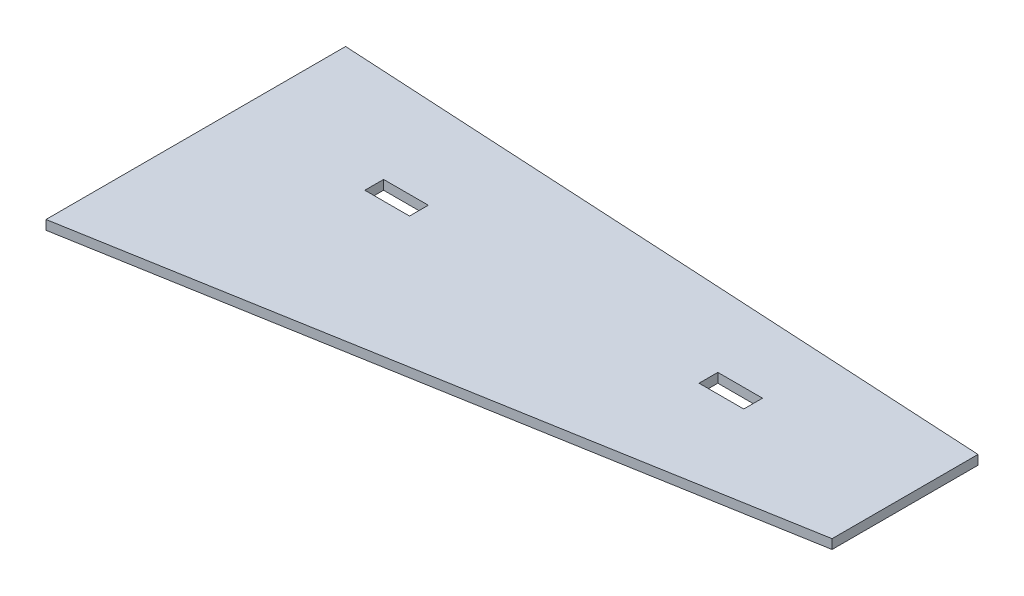
ISO-10303-21;
HEADER;
FILE_DESCRIPTION(('STEP AP214'),'2;1');
FILE_NAME('part.step','',(''),(''),'','','');
FILE_SCHEMA(('AUTOMOTIVE_DESIGN { 1 0 10303 214 1 1 1 1 }'));
ENDSEC;
DATA;
#1=APPLICATION_CONTEXT('core data for automotive mechanical design processes');
#2=APPLICATION_PROTOCOL_DEFINITION('international standard','automotive_design',2000,#1);
#3=PRODUCT_CONTEXT('',#1,'mechanical');
#4=PRODUCT('Part','Part','',(#3));
#5=PRODUCT_RELATED_PRODUCT_CATEGORY('part','',(#4));
#6=PRODUCT_DEFINITION_FORMATION('','',#4);
#7=PRODUCT_DEFINITION_CONTEXT('part definition',#1,'design');
#8=PRODUCT_DEFINITION('design','',#6,#7);
#9=PRODUCT_DEFINITION_SHAPE('','',#8);
#10=(LENGTH_UNIT() NAMED_UNIT(*) SI_UNIT(.MILLI.,.METRE.));
#11=(NAMED_UNIT(*) PLANE_ANGLE_UNIT() SI_UNIT($,.RADIAN.));
#12=(NAMED_UNIT(*) SI_UNIT($,.STERADIAN.) SOLID_ANGLE_UNIT());
#13=UNCERTAINTY_MEASURE_WITH_UNIT(LENGTH_MEASURE(1.E-05),#10,'distance_accuracy_value','');
#14=(GEOMETRIC_REPRESENTATION_CONTEXT(3) GLOBAL_UNCERTAINTY_ASSIGNED_CONTEXT((#13)) GLOBAL_UNIT_ASSIGNED_CONTEXT((#10,
#11,#12)) REPRESENTATION_CONTEXT('',''));
#15=CARTESIAN_POINT('',(0.,0.,0.));
#16=DIRECTION('',(0.,0.,1.));
#17=DIRECTION('',(1.,0.,0.));
#18=AXIS2_PLACEMENT_3D('',#15,#16,#17);
#19=CARTESIAN_POINT('',(0.,5.334,0.));
#20=DIRECTION('',(0.0552977527204317,0.,-0.998469908682315));
#21=DIRECTION('',(-0.998469908682315,0.,-0.0552977527204317));
#22=AXIS2_PLACEMENT_3D('',#19,#20,#21);
#23=PLANE('',#22);
#24=DIRECTION('',(0.998469908682315,0.,0.0552977527204317));
#25=VECTOR('',#24,1.);
#26=CARTESIAN_POINT('',(0.,0.,0.));
#27=LINE('',#26,#25);
#28=CARTESIAN_POINT('',(0.,0.,0.));
#29=VERTEX_POINT('',#28);
#30=CARTESIAN_POINT('',(380.417035207962,0.,21.0684437864845));
#31=VERTEX_POINT('',#30);
#32=EDGE_CURVE('E191',#29,#31,#27,.T.);
#33=ORIENTED_EDGE('',*,*,#32,.F.);
#34=DIRECTION('',(0.,-1.,0.));
#35=VECTOR('',#34,1.);
#36=CARTESIAN_POINT('',(0.,5.334,0.));
#37=LINE('',#36,#35);
#38=CARTESIAN_POINT('',(0.,5.334,0.));
#39=VERTEX_POINT('',#38);
#40=EDGE_CURVE('E11',#39,#29,#37,.T.);
#41=ORIENTED_EDGE('',*,*,#40,.F.);
#42=DIRECTION('',(0.998469908682315,0.,0.0552977527204317));
#43=VECTOR('',#42,1.);
#44=CARTESIAN_POINT('',(0.,5.334,0.));
#45=LINE('',#44,#43);
#46=CARTESIAN_POINT('',(380.417035207962,5.334,21.0684437864845));
#47=VERTEX_POINT('',#46);
#48=EDGE_CURVE('E192',#39,#47,#45,.T.);
#49=ORIENTED_EDGE('',*,*,#48,.T.);
#50=DIRECTION('',(0.,-1.,0.));
#51=VECTOR('',#50,1.);
#52=CARTESIAN_POINT('',(380.417035207962,5.334,21.0684437864845));
#53=LINE('',#52,#51);
#54=EDGE_CURVE('E204',#47,#31,#53,.T.);
#55=ORIENTED_EDGE('',*,*,#54,.T.);
#56=EDGE_LOOP('',(#33,#41,#49,#55));
#57=FACE_BOUND('',#56,.T.);
#58=ADVANCED_FACE('F38',(#57),#23,.T.);
#59=CARTESIAN_POINT('',(0.,5.334,0.));
#60=DIRECTION('',(1.,0.,0.));
#61=DIRECTION('',(0.,0.,-1.));
#62=AXIS2_PLACEMENT_3D('',#59,#60,#61);
#63=PLANE('',#62);
#64=DIRECTION('',(0.,0.,1.));
#65=VECTOR('',#64,1.);
#66=CARTESIAN_POINT('',(0.,0.,0.));
#67=LINE('',#66,#65);
#68=CARTESIAN_POINT('',(0.,0.,170.235385513396));
#69=VERTEX_POINT('',#68);
#70=EDGE_CURVE('E207',#29,#69,#67,.T.);
#71=ORIENTED_EDGE('',*,*,#70,.T.);
#72=DIRECTION('',(0.,-1.,0.));
#73=VECTOR('',#72,1.);
#74=CARTESIAN_POINT('',(0.,5.334,170.235385513396));
#75=LINE('',#74,#73);
#76=CARTESIAN_POINT('',(0.,5.334,170.235385513396));
#77=VERTEX_POINT('',#76);
#78=EDGE_CURVE('E45',#77,#69,#75,.T.);
#79=ORIENTED_EDGE('',*,*,#78,.F.);
#80=DIRECTION('',(0.,0.,1.));
#81=VECTOR('',#80,1.);
#82=CARTESIAN_POINT('',(0.,5.334,0.));
#83=LINE('',#82,#81);
#84=EDGE_CURVE('E195',#39,#77,#83,.T.);
#85=ORIENTED_EDGE('',*,*,#84,.F.);
#86=ORIENTED_EDGE('',*,*,#40,.T.);
#87=EDGE_LOOP('',(#71,#79,#85,#86));
#88=FACE_BOUND('',#87,.T.);
#89=ADVANCED_FACE('F225',(#88),#63,.F.);
#90=CARTESIAN_POINT('',(28.7746575307284,5.334,165.224126357333));
#91=DIRECTION('',(0.171572828941037,0.,0.985171439075032));
#92=DIRECTION('',(0.985171439075032,0.,-0.171572828941037));
#93=AXIS2_PLACEMENT_3D('',#90,#91,#92);
#94=PLANE('',#93);
#95=DIRECTION('',(-0.985171439075032,0.,0.171572828941037));
#96=VECTOR('',#95,1.);
#97=CARTESIAN_POINT('',(28.7746575307284,0.,165.224126357333));
#98=LINE('',#97,#96);
#99=CARTESIAN_POINT('',(380.417035207962,0.,103.983742074288));
#100=VERTEX_POINT('',#99);
#101=EDGE_CURVE('E210',#100,#69,#98,.T.);
#102=ORIENTED_EDGE('',*,*,#101,.F.);
#103=DIRECTION('',(0.,-1.,0.));
#104=VECTOR('',#103,1.);
#105=CARTESIAN_POINT('',(380.417035207962,5.334,103.983742074288));
#106=LINE('',#105,#104);
#107=CARTESIAN_POINT('',(380.417035207962,5.334,103.983742074288));
#108=VERTEX_POINT('',#107);
#109=EDGE_CURVE('E216',#108,#100,#106,.T.);
#110=ORIENTED_EDGE('',*,*,#109,.F.);
#111=DIRECTION('',(-0.985171439075032,0.,0.171572828941037));
#112=VECTOR('',#111,1.);
#113=CARTESIAN_POINT('',(28.7746575307284,5.334,165.224126357333));
#114=LINE('',#113,#112);
#115=EDGE_CURVE('E198',#108,#77,#114,.T.);
#116=ORIENTED_EDGE('',*,*,#115,.T.);
#117=ORIENTED_EDGE('',*,*,#78,.T.);
#118=EDGE_LOOP('',(#102,#110,#116,#117));
#119=FACE_BOUND('',#118,.T.);
#120=ADVANCED_FACE('F220',(#119),#94,.T.);
#121=CARTESIAN_POINT('',(380.417035207962,5.334,0.));
#122=DIRECTION('',(1.,0.,0.));
#123=DIRECTION('',(0.,0.,-1.));
#124=AXIS2_PLACEMENT_3D('',#121,#122,#123);
#125=PLANE('',#124);
#126=DIRECTION('',(0.,0.,1.));
#127=VECTOR('',#126,1.);
#128=CARTESIAN_POINT('',(380.417035207962,0.,0.));
#129=LINE('',#128,#127);
#130=EDGE_CURVE('E196',#31,#100,#129,.T.);
#131=ORIENTED_EDGE('',*,*,#130,.F.);
#132=ORIENTED_EDGE('',*,*,#54,.F.);
#133=DIRECTION('',(0.,0.,1.));
#134=VECTOR('',#133,1.);
#135=CARTESIAN_POINT('',(380.417035207962,5.334,0.));
#136=LINE('',#135,#134);
#137=EDGE_CURVE('E201',#47,#108,#136,.T.);
#138=ORIENTED_EDGE('',*,*,#137,.T.);
#139=ORIENTED_EDGE('',*,*,#109,.T.);
#140=EDGE_LOOP('',(#131,#132,#138,#139));
#141=FACE_BOUND('',#140,.T.);
#142=ADVANCED_FACE('F231',(#141),#125,.T.);
#143=CARTESIAN_POINT('',(0.,5.334,0.));
#144=DIRECTION('',(0.,1.,0.));
#145=DIRECTION('',(0.,0.,1.));
#146=AXIS2_PLACEMENT_3D('',#143,#144,#145);
#147=PLANE('',#146);
#148=DIRECTION('',(1.,0.,0.));
#149=VECTOR('',#148,1.);
#150=CARTESIAN_POINT('',(76.1999999999993,5.334,54.6115268567689));
#151=LINE('',#150,#149);
#152=CARTESIAN_POINT('',(76.1999999999993,5.334,54.6115268567689));
#153=VERTEX_POINT('',#152);
#154=CARTESIAN_POINT('',(101.599999999999,5.334,54.6115268567689));
#155=VERTEX_POINT('',#154);
#156=EDGE_CURVE('E135',#153,#155,#151,.T.);
#157=ORIENTED_EDGE('',*,*,#156,.T.);
#158=DIRECTION('',(0.,0.,1.));
#159=VECTOR('',#158,1.);
#160=CARTESIAN_POINT('',(101.599999999999,5.334,54.6115268567689));
#161=LINE('',#160,#159);
#162=CARTESIAN_POINT('',(101.599999999999,5.334,65.2795268567689));
#163=VERTEX_POINT('',#162);
#164=EDGE_CURVE('E124',#155,#163,#161,.T.);
#165=ORIENTED_EDGE('',*,*,#164,.T.);
#166=DIRECTION('',(-1.,0.,0.));
#167=VECTOR('',#166,1.);
#168=CARTESIAN_POINT('',(101.599999999999,5.334,65.2795268567689));
#169=LINE('',#168,#167);
#170=CARTESIAN_POINT('',(76.1999999999993,5.334,65.2795268567689));
#171=VERTEX_POINT('',#170);
#172=EDGE_CURVE('E146',#163,#171,#169,.T.);
#173=ORIENTED_EDGE('',*,*,#172,.T.);
#174=DIRECTION('',(0.,0.,-1.));
#175=VECTOR('',#174,1.);
#176=CARTESIAN_POINT('',(76.1999999999993,5.334,65.2795268567689));
#177=LINE('',#176,#175);
#178=EDGE_CURVE('E142',#171,#153,#177,.T.);
#179=ORIENTED_EDGE('',*,*,#178,.T.);
#180=EDGE_LOOP('',(#157,#165,#173,#179));
#181=FACE_BOUND('',#180,.T.);
#182=DIRECTION('',(1.,0.,0.));
#183=VECTOR('',#182,1.);
#184=CARTESIAN_POINT('',(266.117035207962,5.334,54.6115268567689));
#185=LINE('',#184,#183);
#186=CARTESIAN_POINT('',(266.117035207962,5.334,54.6115268567689));
#187=VERTEX_POINT('',#186);
#188=CARTESIAN_POINT('',(291.517035207962,5.334,54.6115268567689));
#189=VERTEX_POINT('',#188);
#190=EDGE_CURVE('E165',#187,#189,#185,.T.);
#191=ORIENTED_EDGE('',*,*,#190,.T.);
#192=DIRECTION('',(0.,0.,1.));
#193=VECTOR('',#192,1.);
#194=CARTESIAN_POINT('',(291.517035207962,5.334,54.6115268567689));
#195=LINE('',#194,#193);
#196=CARTESIAN_POINT('',(291.517035207962,5.334,65.2795268567689));
#197=VERTEX_POINT('',#196);
#198=EDGE_CURVE('E182',#189,#197,#195,.T.);
#199=ORIENTED_EDGE('',*,*,#198,.T.);
#200=DIRECTION('',(-1.,0.,0.));
#201=VECTOR('',#200,1.);
#202=CARTESIAN_POINT('',(291.517035207962,5.334,65.2795268567689));
#203=LINE('',#202,#201);
#204=CARTESIAN_POINT('',(266.117035207962,5.334,65.2795268567689));
#205=VERTEX_POINT('',#204);
#206=EDGE_CURVE('E131',#197,#205,#203,.T.);
#207=ORIENTED_EDGE('',*,*,#206,.T.);
#208=DIRECTION('',(0.,0.,-1.));
#209=VECTOR('',#208,1.);
#210=CARTESIAN_POINT('',(266.117035207962,5.334,65.2795268567689));
#211=LINE('',#210,#209);
#212=EDGE_CURVE('E162',#205,#187,#211,.T.);
#213=ORIENTED_EDGE('',*,*,#212,.T.);
#214=EDGE_LOOP('',(#191,#199,#207,#213));
#215=FACE_BOUND('',#214,.T.);
#216=ORIENTED_EDGE('',*,*,#48,.F.);
#217=ORIENTED_EDGE('',*,*,#84,.T.);
#218=ORIENTED_EDGE('',*,*,#115,.F.);
#219=ORIENTED_EDGE('',*,*,#137,.F.);
#220=EDGE_LOOP('',(#216,#217,#218,#219));
#221=FACE_BOUND('',#220,.T.);
#222=ADVANCED_FACE('F140',(#181,#215,#221),#147,.T.);
#223=CARTESIAN_POINT('',(0.,0.,0.));
#224=DIRECTION('',(0.,1.,0.));
#225=DIRECTION('',(0.,0.,1.));
#226=AXIS2_PLACEMENT_3D('',#223,#224,#225);
#227=PLANE('',#226);
#228=DIRECTION('',(0.,0.,1.));
#229=VECTOR('',#228,1.);
#230=CARTESIAN_POINT('',(101.599999999999,0.,54.6115268567689));
#231=LINE('',#230,#229);
#232=CARTESIAN_POINT('',(101.599999999999,0.,54.6115268567689));
#233=VERTEX_POINT('',#232);
#234=CARTESIAN_POINT('',(101.599999999999,0.,65.2795268567689));
#235=VERTEX_POINT('',#234);
#236=EDGE_CURVE('E144',#233,#235,#231,.T.);
#237=ORIENTED_EDGE('',*,*,#236,.F.);
#238=DIRECTION('',(1.,0.,0.));
#239=VECTOR('',#238,1.);
#240=CARTESIAN_POINT('',(76.1999999999993,0.,54.6115268567689));
#241=LINE('',#240,#239);
#242=CARTESIAN_POINT('',(76.1999999999993,0.,54.6115268567689));
#243=VERTEX_POINT('',#242);
#244=EDGE_CURVE('E60',#243,#233,#241,.T.);
#245=ORIENTED_EDGE('',*,*,#244,.F.);
#246=DIRECTION('',(0.,0.,-1.));
#247=VECTOR('',#246,1.);
#248=CARTESIAN_POINT('',(76.1999999999993,0.,65.2795268567689));
#249=LINE('',#248,#247);
#250=CARTESIAN_POINT('',(76.1999999999993,0.,65.2795268567689));
#251=VERTEX_POINT('',#250);
#252=EDGE_CURVE('E137',#251,#243,#249,.T.);
#253=ORIENTED_EDGE('',*,*,#252,.F.);
#254=DIRECTION('',(-1.,0.,0.));
#255=VECTOR('',#254,1.);
#256=CARTESIAN_POINT('',(101.599999999999,0.,65.2795268567689));
#257=LINE('',#256,#255);
#258=EDGE_CURVE('E151',#235,#251,#257,.T.);
#259=ORIENTED_EDGE('',*,*,#258,.F.);
#260=EDGE_LOOP('',(#237,#245,#253,#259));
#261=FACE_BOUND('',#260,.T.);
#262=DIRECTION('',(0.,0.,1.));
#263=VECTOR('',#262,1.);
#264=CARTESIAN_POINT('',(291.517035207962,0.,54.6115268567689));
#265=LINE('',#264,#263);
#266=CARTESIAN_POINT('',(291.517035207962,0.,54.6115268567689));
#267=VERTEX_POINT('',#266);
#268=CARTESIAN_POINT('',(291.517035207962,0.,65.2795268567689));
#269=VERTEX_POINT('',#268);
#270=EDGE_CURVE('E170',#267,#269,#265,.T.);
#271=ORIENTED_EDGE('',*,*,#270,.F.);
#272=DIRECTION('',(1.,0.,0.));
#273=VECTOR('',#272,1.);
#274=CARTESIAN_POINT('',(266.117035207962,0.,54.6115268567689));
#275=LINE('',#274,#273);
#276=CARTESIAN_POINT('',(266.117035207962,0.,54.6115268567689));
#277=VERTEX_POINT('',#276);
#278=EDGE_CURVE('E168',#277,#267,#275,.T.);
#279=ORIENTED_EDGE('',*,*,#278,.F.);
#280=DIRECTION('',(0.,0.,-1.));
#281=VECTOR('',#280,1.);
#282=CARTESIAN_POINT('',(266.117035207962,0.,65.2795268567689));
#283=LINE('',#282,#281);
#284=CARTESIAN_POINT('',(266.117035207962,0.,65.2795268567689));
#285=VERTEX_POINT('',#284);
#286=EDGE_CURVE('E176',#285,#277,#283,.T.);
#287=ORIENTED_EDGE('',*,*,#286,.F.);
#288=DIRECTION('',(-1.,0.,0.));
#289=VECTOR('',#288,1.);
#290=CARTESIAN_POINT('',(291.517035207962,0.,65.2795268567689));
#291=LINE('',#290,#289);
#292=EDGE_CURVE('E173',#269,#285,#291,.T.);
#293=ORIENTED_EDGE('',*,*,#292,.F.);
#294=EDGE_LOOP('',(#271,#279,#287,#293));
#295=FACE_BOUND('',#294,.T.);
#296=ORIENTED_EDGE('',*,*,#32,.T.);
#297=ORIENTED_EDGE('',*,*,#130,.T.);
#298=ORIENTED_EDGE('',*,*,#101,.T.);
#299=ORIENTED_EDGE('',*,*,#70,.F.);
#300=EDGE_LOOP('',(#296,#297,#298,#299));
#301=FACE_BOUND('',#300,.T.);
#302=ADVANCED_FACE('F228',(#261,#295,#301),#227,.F.);
#303=CARTESIAN_POINT('',(266.117035207962,5.335,54.6115268567689));
#304=DIRECTION('',(0.,0.,-1.));
#305=DIRECTION('',(-1.,0.,0.));
#306=AXIS2_PLACEMENT_3D('',#303,#304,#305);
#307=PLANE('',#306);
#308=DIRECTION('',(0.,-1.,0.));
#309=VECTOR('',#308,1.);
#310=CARTESIAN_POINT('',(266.117035207962,5.335,54.6115268567689));
#311=LINE('',#310,#309);
#312=EDGE_CURVE('E180',#187,#277,#311,.T.);
#313=ORIENTED_EDGE('',*,*,#312,.T.);
#314=ORIENTED_EDGE('',*,*,#278,.T.);
#315=DIRECTION('',(0.,-1.,0.));
#316=VECTOR('',#315,1.);
#317=CARTESIAN_POINT('',(291.517035207962,5.335,54.6115268567689));
#318=LINE('',#317,#316);
#319=EDGE_CURVE('E179',#189,#267,#318,.T.);
#320=ORIENTED_EDGE('',*,*,#319,.F.);
#321=ORIENTED_EDGE('',*,*,#190,.F.);
#322=EDGE_LOOP('',(#313,#314,#320,#321));
#323=FACE_BOUND('',#322,.T.);
#324=ADVANCED_FACE('F249',(#323),#307,.F.);
#325=CARTESIAN_POINT('',(266.117035207962,5.335,65.2795268567689));
#326=DIRECTION('',(-1.,0.,0.));
#327=DIRECTION('',(0.,0.,1.));
#328=AXIS2_PLACEMENT_3D('',#325,#326,#327);
#329=PLANE('',#328);
#330=DIRECTION('',(0.,-1.,0.));
#331=VECTOR('',#330,1.);
#332=CARTESIAN_POINT('',(266.117035207962,5.335,65.2795268567689));
#333=LINE('',#332,#331);
#334=EDGE_CURVE('E183',#205,#285,#333,.T.);
#335=ORIENTED_EDGE('',*,*,#334,.T.);
#336=ORIENTED_EDGE('',*,*,#286,.T.);
#337=ORIENTED_EDGE('',*,*,#312,.F.);
#338=ORIENTED_EDGE('',*,*,#212,.F.);
#339=EDGE_LOOP('',(#335,#336,#337,#338));
#340=FACE_BOUND('',#339,.T.);
#341=ADVANCED_FACE('F255',(#340),#329,.F.);
#342=CARTESIAN_POINT('',(291.517035207962,5.335,65.2795268567689));
#343=DIRECTION('',(0.,0.,1.));
#344=DIRECTION('',(1.,0.,0.));
#345=AXIS2_PLACEMENT_3D('',#342,#343,#344);
#346=PLANE('',#345);
#347=DIRECTION('',(0.,-1.,0.));
#348=VECTOR('',#347,1.);
#349=CARTESIAN_POINT('',(291.517035207962,5.335,65.2795268567689));
#350=LINE('',#349,#348);
#351=EDGE_CURVE('E185',#197,#269,#350,.T.);
#352=ORIENTED_EDGE('',*,*,#351,.T.);
#353=ORIENTED_EDGE('',*,*,#292,.T.);
#354=ORIENTED_EDGE('',*,*,#334,.F.);
#355=ORIENTED_EDGE('',*,*,#206,.F.);
#356=EDGE_LOOP('',(#352,#353,#354,#355));
#357=FACE_BOUND('',#356,.T.);
#358=ADVANCED_FACE('F260',(#357),#346,.F.);
#359=CARTESIAN_POINT('',(291.517035207962,5.335,54.6115268567689));
#360=DIRECTION('',(1.,0.,0.));
#361=DIRECTION('',(0.,0.,-1.));
#362=AXIS2_PLACEMENT_3D('',#359,#360,#361);
#363=PLANE('',#362);
#364=ORIENTED_EDGE('',*,*,#319,.T.);
#365=ORIENTED_EDGE('',*,*,#270,.T.);
#366=ORIENTED_EDGE('',*,*,#351,.F.);
#367=ORIENTED_EDGE('',*,*,#198,.F.);
#368=EDGE_LOOP('',(#364,#365,#366,#367));
#369=FACE_BOUND('',#368,.T.);
#370=ADVANCED_FACE('F257',(#369),#363,.F.);
#371=CARTESIAN_POINT('',(76.1999999999993,5.335,54.6115268567689));
#372=DIRECTION('',(0.,0.,-1.));
#373=DIRECTION('',(-1.,0.,0.));
#374=AXIS2_PLACEMENT_3D('',#371,#372,#373);
#375=PLANE('',#374);
#376=DIRECTION('',(0.,-1.,0.));
#377=VECTOR('',#376,1.);
#378=CARTESIAN_POINT('',(76.1999999999993,5.335,54.6115268567689));
#379=LINE('',#378,#377);
#380=EDGE_CURVE('E132',#153,#243,#379,.T.);
#381=ORIENTED_EDGE('',*,*,#380,.T.);
#382=ORIENTED_EDGE('',*,*,#244,.T.);
#383=DIRECTION('',(0.,-1.,0.));
#384=VECTOR('',#383,1.);
#385=CARTESIAN_POINT('',(101.599999999999,5.335,54.6115268567689));
#386=LINE('',#385,#384);
#387=EDGE_CURVE('E126',#155,#233,#386,.T.);
#388=ORIENTED_EDGE('',*,*,#387,.F.);
#389=ORIENTED_EDGE('',*,*,#156,.F.);
#390=EDGE_LOOP('',(#381,#382,#388,#389));
#391=FACE_BOUND('',#390,.T.);
#392=ADVANCED_FACE('F134',(#391),#375,.F.);
#393=CARTESIAN_POINT('',(76.1999999999993,5.335,65.2795268567689));
#394=DIRECTION('',(-1.,0.,0.));
#395=DIRECTION('',(0.,0.,1.));
#396=AXIS2_PLACEMENT_3D('',#393,#394,#395);
#397=PLANE('',#396);
#398=DIRECTION('',(0.,-1.,0.));
#399=VECTOR('',#398,1.);
#400=CARTESIAN_POINT('',(76.1999999999993,5.335,65.2795268567689));
#401=LINE('',#400,#399);
#402=EDGE_CURVE('E157',#171,#251,#401,.T.);
#403=ORIENTED_EDGE('',*,*,#402,.T.);
#404=ORIENTED_EDGE('',*,*,#252,.T.);
#405=ORIENTED_EDGE('',*,*,#380,.F.);
#406=ORIENTED_EDGE('',*,*,#178,.F.);
#407=EDGE_LOOP('',(#403,#404,#405,#406));
#408=FACE_BOUND('',#407,.T.);
#409=ADVANCED_FACE('F270',(#408),#397,.F.);
#410=CARTESIAN_POINT('',(101.599999999999,5.335,65.2795268567689));
#411=DIRECTION('',(0.,0.,1.));
#412=DIRECTION('',(1.,0.,0.));
#413=AXIS2_PLACEMENT_3D('',#410,#411,#412);
#414=PLANE('',#413);
#415=DIRECTION('',(0.,-1.,0.));
#416=VECTOR('',#415,1.);
#417=CARTESIAN_POINT('',(101.599999999999,5.335,65.2795268567689));
#418=LINE('',#417,#416);
#419=EDGE_CURVE('E52',#163,#235,#418,.T.);
#420=ORIENTED_EDGE('',*,*,#419,.T.);
#421=ORIENTED_EDGE('',*,*,#258,.T.);
#422=ORIENTED_EDGE('',*,*,#402,.F.);
#423=ORIENTED_EDGE('',*,*,#172,.F.);
#424=EDGE_LOOP('',(#420,#421,#422,#423));
#425=FACE_BOUND('',#424,.T.);
#426=ADVANCED_FACE('F273',(#425),#414,.F.);
#427=CARTESIAN_POINT('',(101.599999999999,5.335,54.6115268567689));
#428=DIRECTION('',(1.,0.,0.));
#429=DIRECTION('',(0.,0.,-1.));
#430=AXIS2_PLACEMENT_3D('',#427,#428,#429);
#431=PLANE('',#430);
#432=ORIENTED_EDGE('',*,*,#387,.T.);
#433=ORIENTED_EDGE('',*,*,#236,.T.);
#434=ORIENTED_EDGE('',*,*,#419,.F.);
#435=ORIENTED_EDGE('',*,*,#164,.F.);
#436=EDGE_LOOP('',(#432,#433,#434,#435));
#437=FACE_BOUND('',#436,.T.);
#438=ADVANCED_FACE('F125',(#437),#431,.F.);
#439=CLOSED_SHELL('',(#58,#89,#120,#142,#222,#302,#324,#341,#358,#370,#392,#409,#426,#438));
#440=MANIFOLD_SOLID_BREP('B2',#439);
#441=ADVANCED_BREP_SHAPE_REPRESENTATION('',(#18,#440),#14);
#442=SHAPE_DEFINITION_REPRESENTATION(#9,#441);
ENDSEC;
END-ISO-10303-21;
